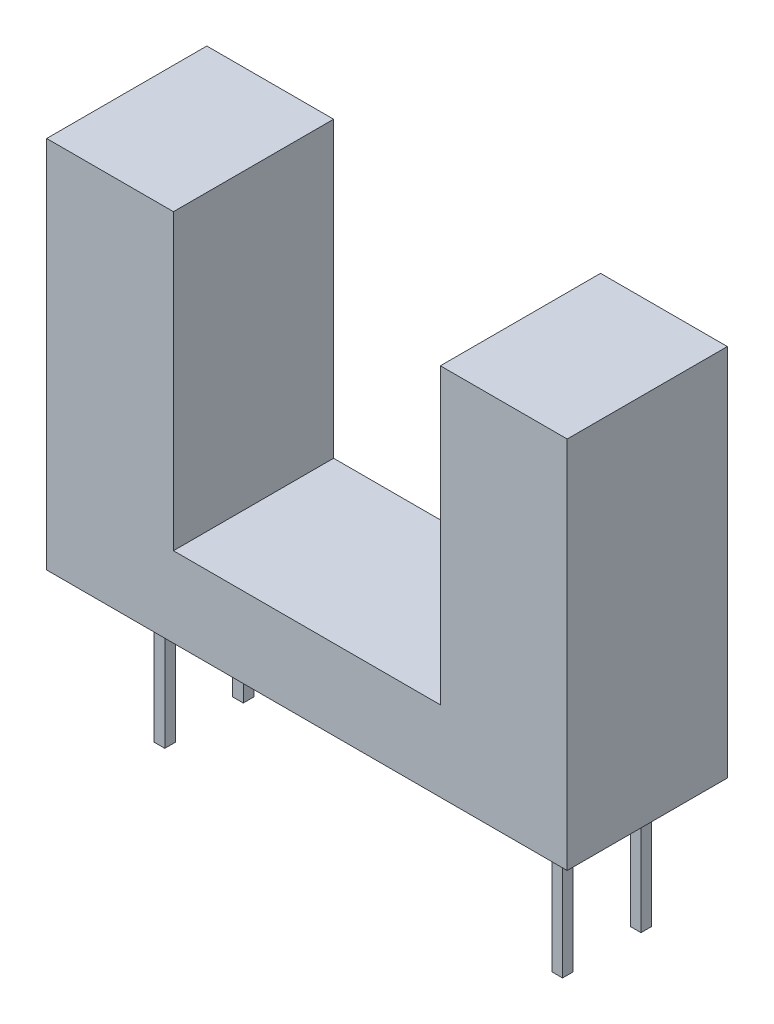
ISO-10303-21;
HEADER;
FILE_DESCRIPTION(('STEP AP214'),'2;1');
FILE_NAME('part.step','',(''),(''),'','','');
FILE_SCHEMA(('AUTOMOTIVE_DESIGN { 1 0 10303 214 1 1 1 1 }'));
ENDSEC;
DATA;
#1=APPLICATION_CONTEXT('core data for automotive mechanical design processes');
#2=APPLICATION_PROTOCOL_DEFINITION('international standard','automotive_design',2000,#1);
#3=PRODUCT_CONTEXT('',#1,'mechanical');
#4=PRODUCT('Part','Part','',(#3));
#5=PRODUCT_RELATED_PRODUCT_CATEGORY('part','',(#4));
#6=PRODUCT_DEFINITION_FORMATION('','',#4);
#7=PRODUCT_DEFINITION_CONTEXT('part definition',#1,'design');
#8=PRODUCT_DEFINITION('design','',#6,#7);
#9=PRODUCT_DEFINITION_SHAPE('','',#8);
#10=(LENGTH_UNIT() NAMED_UNIT(*) SI_UNIT(.MILLI.,.METRE.));
#11=(NAMED_UNIT(*) PLANE_ANGLE_UNIT() SI_UNIT($,.RADIAN.));
#12=(NAMED_UNIT(*) SI_UNIT($,.STERADIAN.) SOLID_ANGLE_UNIT());
#13=UNCERTAINTY_MEASURE_WITH_UNIT(LENGTH_MEASURE(1.E-05),#10,'distance_accuracy_value','');
#14=(GEOMETRIC_REPRESENTATION_CONTEXT(3) GLOBAL_UNCERTAINTY_ASSIGNED_CONTEXT((#13)) GLOBAL_UNIT_ASSIGNED_CONTEXT((#10,
#11,#12)) REPRESENTATION_CONTEXT('',''));
#15=CARTESIAN_POINT('',(0.,0.,0.));
#16=DIRECTION('',(0.,0.,1.));
#17=DIRECTION('',(1.,0.,0.));
#18=AXIS2_PLACEMENT_3D('',#15,#16,#17);
#19=CARTESIAN_POINT('',(-9.75,-7.,6.));
#20=DIRECTION('',(0.,1.,0.));
#21=DIRECTION('',(0.,0.,1.));
#22=AXIS2_PLACEMENT_3D('',#19,#20,#21);
#23=PLANE('',#22);
#24=DIRECTION('',(-1.,0.,0.));
#25=VECTOR('',#24,1.);
#26=CARTESIAN_POINT('',(7.65,-7.,1.13433300913482));
#27=LINE('',#26,#25);
#28=CARTESIAN_POINT('',(7.65,-7.,1.13433300913482));
#29=VERTEX_POINT('',#28);
#30=CARTESIAN_POINT('',(7.25,-7.,1.13433300913482));
#31=VERTEX_POINT('',#30);
#32=EDGE_CURVE('E223',#29,#31,#27,.T.);
#33=ORIENTED_EDGE('',*,*,#32,.F.);
#34=DIRECTION('',(0.,0.,1.));
#35=VECTOR('',#34,1.);
#36=CARTESIAN_POINT('',(7.65,-7.,1.13433300913482));
#37=LINE('',#36,#35);
#38=CARTESIAN_POINT('',(7.65,-7.,0.734333009134821));
#39=VERTEX_POINT('',#38);
#40=EDGE_CURVE('E255',#39,#29,#37,.T.);
#41=ORIENTED_EDGE('',*,*,#40,.F.);
#42=DIRECTION('',(1.,0.,0.));
#43=VECTOR('',#42,1.);
#44=CARTESIAN_POINT('',(7.65,-7.,0.734333009134821));
#45=LINE('',#44,#43);
#46=CARTESIAN_POINT('',(7.25,-7.,0.734333009134821));
#47=VERTEX_POINT('',#46);
#48=EDGE_CURVE('E260',#47,#39,#45,.T.);
#49=ORIENTED_EDGE('',*,*,#48,.F.);
#50=DIRECTION('',(0.,0.,-1.));
#51=VECTOR('',#50,1.);
#52=CARTESIAN_POINT('',(7.25,-7.,1.13433300913482));
#53=LINE('',#52,#51);
#54=EDGE_CURVE('E261',#31,#47,#53,.T.);
#55=ORIENTED_EDGE('',*,*,#54,.F.);
#56=EDGE_LOOP('',(#33,#41,#49,#55));
#57=FACE_BOUND('',#56,.T.);
#58=DIRECTION('',(0.,0.,-1.));
#59=VECTOR('',#58,1.);
#60=CARTESIAN_POINT('',(-7.65,-7.,4.07433300913482));
#61=LINE('',#60,#59);
#62=CARTESIAN_POINT('',(-7.65,-7.,4.07433300913482));
#63=VERTEX_POINT('',#62);
#64=CARTESIAN_POINT('',(-7.65,-7.,3.67433300913482));
#65=VERTEX_POINT('',#64);
#66=EDGE_CURVE('E233',#63,#65,#61,.T.);
#67=ORIENTED_EDGE('',*,*,#66,.F.);
#68=DIRECTION('',(-1.,0.,0.));
#69=VECTOR('',#68,1.);
#70=CARTESIAN_POINT('',(-7.65,-7.,4.07433300913482));
#71=LINE('',#70,#69);
#72=CARTESIAN_POINT('',(-7.25,-7.,4.07433300913482));
#73=VERTEX_POINT('',#72);
#74=EDGE_CURVE('E305',#73,#63,#71,.T.);
#75=ORIENTED_EDGE('',*,*,#74,.F.);
#76=DIRECTION('',(0.,0.,1.));
#77=VECTOR('',#76,1.);
#78=CARTESIAN_POINT('',(-7.25,-7.,4.07433300913482));
#79=LINE('',#78,#77);
#80=CARTESIAN_POINT('',(-7.25,-7.,3.67433300913482));
#81=VERTEX_POINT('',#80);
#82=EDGE_CURVE('E320',#81,#73,#79,.T.);
#83=ORIENTED_EDGE('',*,*,#82,.F.);
#84=DIRECTION('',(1.,0.,0.));
#85=VECTOR('',#84,1.);
#86=CARTESIAN_POINT('',(-7.65,-7.,3.67433300913482));
#87=LINE('',#86,#85);
#88=EDGE_CURVE('E314',#65,#81,#87,.T.);
#89=ORIENTED_EDGE('',*,*,#88,.F.);
#90=EDGE_LOOP('',(#67,#75,#83,#89));
#91=FACE_BOUND('',#90,.T.);
#92=DIRECTION('',(1.,0.,0.));
#93=VECTOR('',#92,1.);
#94=CARTESIAN_POINT('',(-9.75,-7.,0.));
#95=LINE('',#94,#93);
#96=CARTESIAN_POINT('',(-9.75,-7.,0.));
#97=VERTEX_POINT('',#96);
#98=CARTESIAN_POINT('',(9.75,-7.,0.));
#99=VERTEX_POINT('',#98);
#100=EDGE_CURVE('E373',#97,#99,#95,.T.);
#101=ORIENTED_EDGE('',*,*,#100,.T.);
#102=DIRECTION('',(0.,0.,-1.));
#103=VECTOR('',#102,1.);
#104=CARTESIAN_POINT('',(9.75,-7.,6.));
#105=LINE('',#104,#103);
#106=CARTESIAN_POINT('',(9.75,-7.,6.));
#107=VERTEX_POINT('',#106);
#108=EDGE_CURVE('E377',#107,#99,#105,.T.);
#109=ORIENTED_EDGE('',*,*,#108,.F.);
#110=DIRECTION('',(1.,0.,0.));
#111=VECTOR('',#110,1.);
#112=CARTESIAN_POINT('',(-9.75,-7.,6.));
#113=LINE('',#112,#111);
#114=CARTESIAN_POINT('',(-9.75,-7.,6.));
#115=VERTEX_POINT('',#114);
#116=EDGE_CURVE('E355',#115,#107,#113,.T.);
#117=ORIENTED_EDGE('',*,*,#116,.F.);
#118=DIRECTION('',(0.,0.,-1.));
#119=VECTOR('',#118,1.);
#120=CARTESIAN_POINT('',(-9.75,-7.,6.));
#121=LINE('',#120,#119);
#122=EDGE_CURVE('E48',#115,#97,#121,.T.);
#123=ORIENTED_EDGE('',*,*,#122,.T.);
#124=EDGE_LOOP('',(#101,#109,#117,#123));
#125=FACE_BOUND('',#124,.T.);
#126=DIRECTION('',(0.,0.,-1.));
#127=VECTOR('',#126,1.);
#128=CARTESIAN_POINT('',(-7.65,-7.,1.13433300913482));
#129=LINE('',#128,#127);
#130=CARTESIAN_POINT('',(-7.65,-7.,1.13433300913482));
#131=VERTEX_POINT('',#130);
#132=CARTESIAN_POINT('',(-7.65,-7.,0.734333009134819));
#133=VERTEX_POINT('',#132);
#134=EDGE_CURVE('E220',#131,#133,#129,.T.);
#135=ORIENTED_EDGE('',*,*,#134,.F.);
#136=DIRECTION('',(-1.,0.,0.));
#137=VECTOR('',#136,1.);
#138=CARTESIAN_POINT('',(-7.65,-7.,1.13433300913482));
#139=LINE('',#138,#137);
#140=CARTESIAN_POINT('',(-7.25,-7.,1.13433300913482));
#141=VERTEX_POINT('',#140);
#142=EDGE_CURVE('E201',#141,#131,#139,.T.);
#143=ORIENTED_EDGE('',*,*,#142,.F.);
#144=DIRECTION('',(0.,0.,1.));
#145=VECTOR('',#144,1.);
#146=CARTESIAN_POINT('',(-7.25,-7.,1.13433300913482));
#147=LINE('',#146,#145);
#148=CARTESIAN_POINT('',(-7.25,-7.,0.734333009134819));
#149=VERTEX_POINT('',#148);
#150=EDGE_CURVE('E196',#149,#141,#147,.T.);
#151=ORIENTED_EDGE('',*,*,#150,.F.);
#152=DIRECTION('',(1.,0.,0.));
#153=VECTOR('',#152,1.);
#154=CARTESIAN_POINT('',(-7.65,-7.,0.734333009134819));
#155=LINE('',#154,#153);
#156=EDGE_CURVE('E199',#133,#149,#155,.T.);
#157=ORIENTED_EDGE('',*,*,#156,.F.);
#158=EDGE_LOOP('',(#135,#143,#151,#157));
#159=FACE_BOUND('',#158,.T.);
#160=DIRECTION('',(-1.,0.,0.));
#161=VECTOR('',#160,1.);
#162=CARTESIAN_POINT('',(7.65,-7.,4.07433300913482));
#163=LINE('',#162,#161);
#164=CARTESIAN_POINT('',(7.65,-7.,4.07433300913482));
#165=VERTEX_POINT('',#164);
#166=CARTESIAN_POINT('',(7.25,-7.,4.07433300913482));
#167=VERTEX_POINT('',#166);
#168=EDGE_CURVE('E57',#165,#167,#163,.T.);
#169=ORIENTED_EDGE('',*,*,#168,.F.);
#170=DIRECTION('',(0.,0.,1.));
#171=VECTOR('',#170,1.);
#172=CARTESIAN_POINT('',(7.65,-7.,4.07433300913482));
#173=LINE('',#172,#171);
#174=CARTESIAN_POINT('',(7.65,-7.,3.67433300913482));
#175=VERTEX_POINT('',#174);
#176=EDGE_CURVE('E58',#175,#165,#173,.T.);
#177=ORIENTED_EDGE('',*,*,#176,.F.);
#178=DIRECTION('',(1.,0.,0.));
#179=VECTOR('',#178,1.);
#180=CARTESIAN_POINT('',(7.65,-7.,3.67433300913482));
#181=LINE('',#180,#179);
#182=CARTESIAN_POINT('',(7.25,-7.,3.67433300913482));
#183=VERTEX_POINT('',#182);
#184=EDGE_CURVE('E287',#183,#175,#181,.T.);
#185=ORIENTED_EDGE('',*,*,#184,.F.);
#186=DIRECTION('',(0.,0.,-1.));
#187=VECTOR('',#186,1.);
#188=CARTESIAN_POINT('',(7.25,-7.,4.07433300913482));
#189=LINE('',#188,#187);
#190=EDGE_CURVE('E290',#167,#183,#189,.T.);
#191=ORIENTED_EDGE('',*,*,#190,.F.);
#192=EDGE_LOOP('',(#169,#177,#185,#191));
#193=FACE_BOUND('',#192,.T.);
#194=ADVANCED_FACE('F39',(#57,#91,#125,#159,#193),#23,.F.);
#195=CARTESIAN_POINT('',(-9.75,7.,6.));
#196=DIRECTION('',(0.,1.,0.));
#197=DIRECTION('',(0.,0.,1.));
#198=AXIS2_PLACEMENT_3D('',#195,#196,#197);
#199=PLANE('',#198);
#200=DIRECTION('',(1.,0.,0.));
#201=VECTOR('',#200,1.);
#202=CARTESIAN_POINT('',(-9.75,7.,0.));
#203=LINE('',#202,#201);
#204=CARTESIAN_POINT('',(-9.75,7.,0.));
#205=VERTEX_POINT('',#204);
#206=CARTESIAN_POINT('',(-5.,7.,0.));
#207=VERTEX_POINT('',#206);
#208=EDGE_CURVE('E334',#205,#207,#203,.T.);
#209=ORIENTED_EDGE('',*,*,#208,.F.);
#210=DIRECTION('',(0.,0.,-1.));
#211=VECTOR('',#210,1.);
#212=CARTESIAN_POINT('',(-9.75,7.,6.));
#213=LINE('',#212,#211);
#214=CARTESIAN_POINT('',(-9.75,7.,6.));
#215=VERTEX_POINT('',#214);
#216=EDGE_CURVE('E11',#215,#205,#213,.T.);
#217=ORIENTED_EDGE('',*,*,#216,.F.);
#218=DIRECTION('',(1.,0.,0.));
#219=VECTOR('',#218,1.);
#220=CARTESIAN_POINT('',(-9.75,7.,6.));
#221=LINE('',#220,#219);
#222=CARTESIAN_POINT('',(-5.,7.,6.));
#223=VERTEX_POINT('',#222);
#224=EDGE_CURVE('E331',#215,#223,#221,.T.);
#225=ORIENTED_EDGE('',*,*,#224,.T.);
#226=DIRECTION('',(0.,0.,-1.));
#227=VECTOR('',#226,1.);
#228=CARTESIAN_POINT('',(-5.,7.,6.));
#229=LINE('',#228,#227);
#230=EDGE_CURVE('E43',#223,#207,#229,.T.);
#231=ORIENTED_EDGE('',*,*,#230,.T.);
#232=EDGE_LOOP('',(#209,#217,#225,#231));
#233=FACE_BOUND('',#232,.T.);
#234=ADVANCED_FACE('F41',(#233),#199,.T.);
#235=CARTESIAN_POINT('',(-9.75,7.,6.));
#236=DIRECTION('',(1.,0.,0.));
#237=DIRECTION('',(0.,1.,0.));
#238=AXIS2_PLACEMENT_3D('',#235,#236,#237);
#239=PLANE('',#238);
#240=DIRECTION('',(0.,-1.,0.));
#241=VECTOR('',#240,1.);
#242=CARTESIAN_POINT('',(-9.75,7.,0.));
#243=LINE('',#242,#241);
#244=EDGE_CURVE('E337',#205,#97,#243,.T.);
#245=ORIENTED_EDGE('',*,*,#244,.T.);
#246=ORIENTED_EDGE('',*,*,#122,.F.);
#247=DIRECTION('',(0.,-1.,0.));
#248=VECTOR('',#247,1.);
#249=CARTESIAN_POINT('',(-9.75,7.,6.));
#250=LINE('',#249,#248);
#251=EDGE_CURVE('E353',#215,#115,#250,.T.);
#252=ORIENTED_EDGE('',*,*,#251,.F.);
#253=ORIENTED_EDGE('',*,*,#216,.T.);
#254=EDGE_LOOP('',(#245,#246,#252,#253));
#255=FACE_BOUND('',#254,.T.);
#256=ADVANCED_FACE('F402',(#255),#239,.F.);
#257=CARTESIAN_POINT('',(9.75,7.,6.));
#258=DIRECTION('',(1.,0.,0.));
#259=DIRECTION('',(0.,1.,0.));
#260=AXIS2_PLACEMENT_3D('',#257,#258,#259);
#261=PLANE('',#260);
#262=DIRECTION('',(0.,-1.,0.));
#263=VECTOR('',#262,1.);
#264=CARTESIAN_POINT('',(9.75,7.,0.));
#265=LINE('',#264,#263);
#266=CARTESIAN_POINT('',(9.75,7.,0.));
#267=VERTEX_POINT('',#266);
#268=EDGE_CURVE('E367',#267,#99,#265,.T.);
#269=ORIENTED_EDGE('',*,*,#268,.F.);
#270=DIRECTION('',(0.,0.,-1.));
#271=VECTOR('',#270,1.);
#272=CARTESIAN_POINT('',(9.75,7.,6.));
#273=LINE('',#272,#271);
#274=CARTESIAN_POINT('',(9.75,7.,6.));
#275=VERTEX_POINT('',#274);
#276=EDGE_CURVE('E381',#275,#267,#273,.T.);
#277=ORIENTED_EDGE('',*,*,#276,.F.);
#278=DIRECTION('',(0.,-1.,0.));
#279=VECTOR('',#278,1.);
#280=CARTESIAN_POINT('',(9.75,7.,6.));
#281=LINE('',#280,#279);
#282=EDGE_CURVE('E349',#275,#107,#281,.T.);
#283=ORIENTED_EDGE('',*,*,#282,.T.);
#284=ORIENTED_EDGE('',*,*,#108,.T.);
#285=EDGE_LOOP('',(#269,#277,#283,#284));
#286=FACE_BOUND('',#285,.T.);
#287=ADVANCED_FACE('F425',(#286),#261,.T.);
#288=CARTESIAN_POINT('',(5.,7.,6.));
#289=DIRECTION('',(0.,1.,0.));
#290=DIRECTION('',(-1.,0.,0.));
#291=AXIS2_PLACEMENT_3D('',#288,#289,#290);
#292=PLANE('',#291);
#293=DIRECTION('',(1.,0.,0.));
#294=VECTOR('',#293,1.);
#295=CARTESIAN_POINT('',(5.,7.,0.));
#296=LINE('',#295,#294);
#297=CARTESIAN_POINT('',(5.,7.,0.));
#298=VERTEX_POINT('',#297);
#299=EDGE_CURVE('E370',#298,#267,#296,.T.);
#300=ORIENTED_EDGE('',*,*,#299,.F.);
#301=DIRECTION('',(0.,0.,-1.));
#302=VECTOR('',#301,1.);
#303=CARTESIAN_POINT('',(5.,7.,6.));
#304=LINE('',#303,#302);
#305=CARTESIAN_POINT('',(5.,7.,6.));
#306=VERTEX_POINT('',#305);
#307=EDGE_CURVE('E382',#306,#298,#304,.T.);
#308=ORIENTED_EDGE('',*,*,#307,.F.);
#309=DIRECTION('',(1.,0.,0.));
#310=VECTOR('',#309,1.);
#311=CARTESIAN_POINT('',(5.,7.,6.));
#312=LINE('',#311,#310);
#313=EDGE_CURVE('E347',#306,#275,#312,.T.);
#314=ORIENTED_EDGE('',*,*,#313,.T.);
#315=ORIENTED_EDGE('',*,*,#276,.T.);
#316=EDGE_LOOP('',(#300,#308,#314,#315));
#317=FACE_BOUND('',#316,.T.);
#318=ADVANCED_FACE('F420',(#317),#292,.T.);
#319=CARTESIAN_POINT('',(5.,7.,6.));
#320=DIRECTION('',(1.,0.,0.));
#321=DIRECTION('',(0.,1.,0.));
#322=AXIS2_PLACEMENT_3D('',#319,#320,#321);
#323=PLANE('',#322);
#324=DIRECTION('',(0.,-1.,0.));
#325=VECTOR('',#324,1.);
#326=CARTESIAN_POINT('',(5.,7.,0.));
#327=LINE('',#326,#325);
#328=CARTESIAN_POINT('',(5.,-4.,0.));
#329=VERTEX_POINT('',#328);
#330=EDGE_CURVE('E365',#298,#329,#327,.T.);
#331=ORIENTED_EDGE('',*,*,#330,.T.);
#332=DIRECTION('',(0.,0.,-1.));
#333=VECTOR('',#332,1.);
#334=CARTESIAN_POINT('',(5.,-4.,6.));
#335=LINE('',#334,#333);
#336=CARTESIAN_POINT('',(5.,-4.,6.));
#337=VERTEX_POINT('',#336);
#338=EDGE_CURVE('E384',#337,#329,#335,.T.);
#339=ORIENTED_EDGE('',*,*,#338,.F.);
#340=DIRECTION('',(0.,-1.,0.));
#341=VECTOR('',#340,1.);
#342=CARTESIAN_POINT('',(5.,7.,6.));
#343=LINE('',#342,#341);
#344=EDGE_CURVE('E343',#306,#337,#343,.T.);
#345=ORIENTED_EDGE('',*,*,#344,.F.);
#346=ORIENTED_EDGE('',*,*,#307,.T.);
#347=EDGE_LOOP('',(#331,#339,#345,#346));
#348=FACE_BOUND('',#347,.T.);
#349=ADVANCED_FACE('F427',(#348),#323,.F.);
#350=CARTESIAN_POINT('',(-5.,-4.,6.));
#351=DIRECTION('',(0.,1.,0.));
#352=DIRECTION('',(-1.,0.,0.));
#353=AXIS2_PLACEMENT_3D('',#350,#351,#352);
#354=PLANE('',#353);
#355=DIRECTION('',(1.,0.,0.));
#356=VECTOR('',#355,1.);
#357=CARTESIAN_POINT('',(-5.,-4.,0.));
#358=LINE('',#357,#356);
#359=CARTESIAN_POINT('',(-5.,-4.,0.));
#360=VERTEX_POINT('',#359);
#361=EDGE_CURVE('E363',#360,#329,#358,.T.);
#362=ORIENTED_EDGE('',*,*,#361,.F.);
#363=DIRECTION('',(0.,0.,-1.));
#364=VECTOR('',#363,1.);
#365=CARTESIAN_POINT('',(-5.,-4.,6.));
#366=LINE('',#365,#364);
#367=CARTESIAN_POINT('',(-5.,-4.,6.));
#368=VERTEX_POINT('',#367);
#369=EDGE_CURVE('E387',#368,#360,#366,.T.);
#370=ORIENTED_EDGE('',*,*,#369,.F.);
#371=DIRECTION('',(1.,0.,0.));
#372=VECTOR('',#371,1.);
#373=CARTESIAN_POINT('',(-5.,-4.,6.));
#374=LINE('',#373,#372);
#375=EDGE_CURVE('E341',#368,#337,#374,.T.);
#376=ORIENTED_EDGE('',*,*,#375,.T.);
#377=ORIENTED_EDGE('',*,*,#338,.T.);
#378=EDGE_LOOP('',(#362,#370,#376,#377));
#379=FACE_BOUND('',#378,.T.);
#380=ADVANCED_FACE('F413',(#379),#354,.T.);
#381=CARTESIAN_POINT('',(-5.,7.,6.));
#382=DIRECTION('',(1.,0.,0.));
#383=DIRECTION('',(0.,1.,0.));
#384=AXIS2_PLACEMENT_3D('',#381,#382,#383);
#385=PLANE('',#384);
#386=DIRECTION('',(0.,-1.,0.));
#387=VECTOR('',#386,1.);
#388=CARTESIAN_POINT('',(-5.,7.,0.));
#389=LINE('',#388,#387);
#390=EDGE_CURVE('E359',#207,#360,#389,.T.);
#391=ORIENTED_EDGE('',*,*,#390,.F.);
#392=ORIENTED_EDGE('',*,*,#230,.F.);
#393=DIRECTION('',(0.,-1.,0.));
#394=VECTOR('',#393,1.);
#395=CARTESIAN_POINT('',(-5.,7.,6.));
#396=LINE('',#395,#394);
#397=EDGE_CURVE('E340',#223,#368,#396,.T.);
#398=ORIENTED_EDGE('',*,*,#397,.T.);
#399=ORIENTED_EDGE('',*,*,#369,.T.);
#400=EDGE_LOOP('',(#391,#392,#398,#399));
#401=FACE_BOUND('',#400,.T.);
#402=ADVANCED_FACE('F393',(#401),#385,.T.);
#403=CARTESIAN_POINT('',(0.,0.,6.));
#404=DIRECTION('',(0.,0.,-1.));
#405=DIRECTION('',(-1.,0.,0.));
#406=AXIS2_PLACEMENT_3D('',#403,#404,#405);
#407=PLANE('',#406);
#408=ORIENTED_EDGE('',*,*,#224,.F.);
#409=ORIENTED_EDGE('',*,*,#251,.T.);
#410=ORIENTED_EDGE('',*,*,#116,.T.);
#411=ORIENTED_EDGE('',*,*,#282,.F.);
#412=ORIENTED_EDGE('',*,*,#313,.F.);
#413=ORIENTED_EDGE('',*,*,#344,.T.);
#414=ORIENTED_EDGE('',*,*,#375,.F.);
#415=ORIENTED_EDGE('',*,*,#397,.F.);
#416=EDGE_LOOP('',(#408,#409,#410,#411,#412,#413,#414,#415));
#417=FACE_BOUND('',#416,.T.);
#418=ADVANCED_FACE('F407',(#417),#407,.F.);
#419=CARTESIAN_POINT('',(0.,0.,0.));
#420=DIRECTION('',(0.,0.,-1.));
#421=DIRECTION('',(-1.,0.,0.));
#422=AXIS2_PLACEMENT_3D('',#419,#420,#421);
#423=PLANE('',#422);
#424=ORIENTED_EDGE('',*,*,#208,.T.);
#425=ORIENTED_EDGE('',*,*,#390,.T.);
#426=ORIENTED_EDGE('',*,*,#361,.T.);
#427=ORIENTED_EDGE('',*,*,#330,.F.);
#428=ORIENTED_EDGE('',*,*,#299,.T.);
#429=ORIENTED_EDGE('',*,*,#268,.T.);
#430=ORIENTED_EDGE('',*,*,#100,.F.);
#431=ORIENTED_EDGE('',*,*,#244,.F.);
#432=EDGE_LOOP('',(#424,#425,#426,#427,#428,#429,#430,#431));
#433=FACE_BOUND('',#432,.T.);
#434=ADVANCED_FACE('F397',(#433),#423,.T.);
#435=CARTESIAN_POINT('',(-7.65,-12.5,4.07433300913482));
#436=DIRECTION('',(1.,0.,0.));
#437=DIRECTION('',(0.,0.,-1.));
#438=AXIS2_PLACEMENT_3D('',#435,#436,#437);
#439=PLANE('',#438);
#440=ORIENTED_EDGE('',*,*,#66,.T.);
#441=DIRECTION('',(0.,1.,0.));
#442=VECTOR('',#441,1.);
#443=CARTESIAN_POINT('',(-7.65,-12.5,3.67433300913482));
#444=LINE('',#443,#442);
#445=CARTESIAN_POINT('',(-7.65,-12.5,3.67433300913482));
#446=VERTEX_POINT('',#445);
#447=EDGE_CURVE('E329',#446,#65,#444,.T.);
#448=ORIENTED_EDGE('',*,*,#447,.F.);
#449=DIRECTION('',(0.,0.,-1.));
#450=VECTOR('',#449,1.);
#451=CARTESIAN_POINT('',(-7.65,-12.5,4.07433300913482));
#452=LINE('',#451,#450);
#453=CARTESIAN_POINT('',(-7.65,-12.5,4.07433300913482));
#454=VERTEX_POINT('',#453);
#455=EDGE_CURVE('E301',#454,#446,#452,.T.);
#456=ORIENTED_EDGE('',*,*,#455,.F.);
#457=DIRECTION('',(0.,1.,0.));
#458=VECTOR('',#457,1.);
#459=CARTESIAN_POINT('',(-7.65,-12.5,4.07433300913482));
#460=LINE('',#459,#458);
#461=EDGE_CURVE('E313',#454,#63,#460,.T.);
#462=ORIENTED_EDGE('',*,*,#461,.T.);
#463=EDGE_LOOP('',(#440,#448,#456,#462));
#464=FACE_BOUND('',#463,.T.);
#465=ADVANCED_FACE('F444',(#464),#439,.F.);
#466=CARTESIAN_POINT('',(-7.65,-12.5,3.67433300913482));
#467=DIRECTION('',(0.,0.,1.));
#468=DIRECTION('',(1.,0.,0.));
#469=AXIS2_PLACEMENT_3D('',#466,#467,#468);
#470=PLANE('',#469);
#471=ORIENTED_EDGE('',*,*,#88,.T.);
#472=DIRECTION('',(0.,1.,0.));
#473=VECTOR('',#472,1.);
#474=CARTESIAN_POINT('',(-7.25,-12.5,3.67433300913482));
#475=LINE('',#474,#473);
#476=CARTESIAN_POINT('',(-7.25,-12.5,3.67433300913482));
#477=VERTEX_POINT('',#476);
#478=EDGE_CURVE('E330',#477,#81,#475,.T.);
#479=ORIENTED_EDGE('',*,*,#478,.F.);
#480=DIRECTION('',(1.,0.,0.));
#481=VECTOR('',#480,1.);
#482=CARTESIAN_POINT('',(-7.65,-12.5,3.67433300913482));
#483=LINE('',#482,#481);
#484=EDGE_CURVE('E303',#446,#477,#483,.T.);
#485=ORIENTED_EDGE('',*,*,#484,.F.);
#486=ORIENTED_EDGE('',*,*,#447,.T.);
#487=EDGE_LOOP('',(#471,#479,#485,#486));
#488=FACE_BOUND('',#487,.T.);
#489=ADVANCED_FACE('F450',(#488),#470,.F.);
#490=CARTESIAN_POINT('',(-7.25,-12.5,4.07433300913482));
#491=DIRECTION('',(-1.,0.,0.));
#492=DIRECTION('',(0.,0.,1.));
#493=AXIS2_PLACEMENT_3D('',#490,#491,#492);
#494=PLANE('',#493);
#495=ORIENTED_EDGE('',*,*,#82,.T.);
#496=DIRECTION('',(0.,1.,0.));
#497=VECTOR('',#496,1.);
#498=CARTESIAN_POINT('',(-7.25,-12.5,4.07433300913482));
#499=LINE('',#498,#497);
#500=CARTESIAN_POINT('',(-7.25,-12.5,4.07433300913482));
#501=VERTEX_POINT('',#500);
#502=EDGE_CURVE('E322',#501,#73,#499,.T.);
#503=ORIENTED_EDGE('',*,*,#502,.F.);
#504=DIRECTION('',(0.,0.,1.));
#505=VECTOR('',#504,1.);
#506=CARTESIAN_POINT('',(-7.25,-12.5,4.07433300913482));
#507=LINE('',#506,#505);
#508=EDGE_CURVE('E307',#477,#501,#507,.T.);
#509=ORIENTED_EDGE('',*,*,#508,.F.);
#510=ORIENTED_EDGE('',*,*,#478,.T.);
#511=EDGE_LOOP('',(#495,#503,#509,#510));
#512=FACE_BOUND('',#511,.T.);
#513=ADVANCED_FACE('F451',(#512),#494,.F.);
#514=CARTESIAN_POINT('',(-7.65,-12.5,4.07433300913482));
#515=DIRECTION('',(0.,0.,-1.));
#516=DIRECTION('',(-1.,0.,0.));
#517=AXIS2_PLACEMENT_3D('',#514,#515,#516);
#518=PLANE('',#517);
#519=ORIENTED_EDGE('',*,*,#74,.T.);
#520=ORIENTED_EDGE('',*,*,#461,.F.);
#521=DIRECTION('',(-1.,0.,0.));
#522=VECTOR('',#521,1.);
#523=CARTESIAN_POINT('',(-7.65,-12.5,4.07433300913482));
#524=LINE('',#523,#522);
#525=EDGE_CURVE('E310',#501,#454,#524,.T.);
#526=ORIENTED_EDGE('',*,*,#525,.F.);
#527=ORIENTED_EDGE('',*,*,#502,.T.);
#528=EDGE_LOOP('',(#519,#520,#526,#527));
#529=FACE_BOUND('',#528,.T.);
#530=ADVANCED_FACE('F455',(#529),#518,.F.);
#531=CARTESIAN_POINT('',(0.,-12.5,0.));
#532=DIRECTION('',(0.,-1.,0.));
#533=DIRECTION('',(0.,0.,-1.));
#534=AXIS2_PLACEMENT_3D('',#531,#532,#533);
#535=PLANE('',#534);
#536=ORIENTED_EDGE('',*,*,#455,.T.);
#537=ORIENTED_EDGE('',*,*,#484,.T.);
#538=ORIENTED_EDGE('',*,*,#508,.T.);
#539=ORIENTED_EDGE('',*,*,#525,.T.);
#540=EDGE_LOOP('',(#536,#537,#538,#539));
#541=FACE_BOUND('',#540,.T.);
#542=ADVANCED_FACE('F459',(#541),#535,.T.);
#543=CARTESIAN_POINT('',(-7.65,-12.5,1.13433300913482));
#544=DIRECTION('',(1.,0.,0.));
#545=DIRECTION('',(0.,0.,-1.));
#546=AXIS2_PLACEMENT_3D('',#543,#544,#545);
#547=PLANE('',#546);
#548=ORIENTED_EDGE('',*,*,#134,.T.);
#549=DIRECTION('',(0.,1.,0.));
#550=VECTOR('',#549,1.);
#551=CARTESIAN_POINT('',(-7.65,-12.5,0.734333009134819));
#552=LINE('',#551,#550);
#553=CARTESIAN_POINT('',(-7.65,-12.5,0.734333009134819));
#554=VERTEX_POINT('',#553);
#555=EDGE_CURVE('E214',#554,#133,#552,.T.);
#556=ORIENTED_EDGE('',*,*,#555,.F.);
#557=DIRECTION('',(0.,0.,-1.));
#558=VECTOR('',#557,1.);
#559=CARTESIAN_POINT('',(-7.65,-12.5,1.13433300913482));
#560=LINE('',#559,#558);
#561=CARTESIAN_POINT('',(-7.65,-12.5,1.13433300913482));
#562=VERTEX_POINT('',#561);
#563=EDGE_CURVE('E231',#562,#554,#560,.T.);
#564=ORIENTED_EDGE('',*,*,#563,.F.);
#565=DIRECTION('',(0.,1.,0.));
#566=VECTOR('',#565,1.);
#567=CARTESIAN_POINT('',(-7.65,-12.5,1.13433300913482));
#568=LINE('',#567,#566);
#569=EDGE_CURVE('E224',#562,#131,#568,.T.);
#570=ORIENTED_EDGE('',*,*,#569,.T.);
#571=EDGE_LOOP('',(#548,#556,#564,#570));
#572=FACE_BOUND('',#571,.T.);
#573=ADVANCED_FACE('F462',(#572),#547,.F.);
#574=CARTESIAN_POINT('',(-7.65,-12.5,0.734333009134819));
#575=DIRECTION('',(0.,0.,1.));
#576=DIRECTION('',(1.,0.,0.));
#577=AXIS2_PLACEMENT_3D('',#574,#575,#576);
#578=PLANE('',#577);
#579=ORIENTED_EDGE('',*,*,#156,.T.);
#580=DIRECTION('',(0.,1.,0.));
#581=VECTOR('',#580,1.);
#582=CARTESIAN_POINT('',(-7.25,-12.5,0.734333009134819));
#583=LINE('',#582,#581);
#584=CARTESIAN_POINT('',(-7.25,-12.5,0.734333009134819));
#585=VERTEX_POINT('',#584);
#586=EDGE_CURVE('E215',#585,#149,#583,.T.);
#587=ORIENTED_EDGE('',*,*,#586,.F.);
#588=DIRECTION('',(1.,0.,0.));
#589=VECTOR('',#588,1.);
#590=CARTESIAN_POINT('',(-7.65,-12.5,0.734333009134819));
#591=LINE('',#590,#589);
#592=EDGE_CURVE('E240',#554,#585,#591,.T.);
#593=ORIENTED_EDGE('',*,*,#592,.F.);
#594=ORIENTED_EDGE('',*,*,#555,.T.);
#595=EDGE_LOOP('',(#579,#587,#593,#594));
#596=FACE_BOUND('',#595,.T.);
#597=ADVANCED_FACE('F211',(#596),#578,.F.);
#598=CARTESIAN_POINT('',(-7.25,-12.5,1.13433300913482));
#599=DIRECTION('',(-1.,0.,0.));
#600=DIRECTION('',(0.,0.,1.));
#601=AXIS2_PLACEMENT_3D('',#598,#599,#600);
#602=PLANE('',#601);
#603=ORIENTED_EDGE('',*,*,#150,.T.);
#604=DIRECTION('',(0.,1.,0.));
#605=VECTOR('',#604,1.);
#606=CARTESIAN_POINT('',(-7.25,-12.5,1.13433300913482));
#607=LINE('',#606,#605);
#608=CARTESIAN_POINT('',(-7.25,-12.5,1.13433300913482));
#609=VERTEX_POINT('',#608);
#610=EDGE_CURVE('E222',#609,#141,#607,.T.);
#611=ORIENTED_EDGE('',*,*,#610,.F.);
#612=DIRECTION('',(0.,0.,1.));
#613=VECTOR('',#612,1.);
#614=CARTESIAN_POINT('',(-7.25,-12.5,1.13433300913482));
#615=LINE('',#614,#613);
#616=EDGE_CURVE('E219',#585,#609,#615,.T.);
#617=ORIENTED_EDGE('',*,*,#616,.F.);
#618=ORIENTED_EDGE('',*,*,#586,.T.);
#619=EDGE_LOOP('',(#603,#611,#617,#618));
#620=FACE_BOUND('',#619,.T.);
#621=ADVANCED_FACE('F218',(#620),#602,.F.);
#622=CARTESIAN_POINT('',(-7.65,-12.5,1.13433300913482));
#623=DIRECTION('',(0.,0.,-1.));
#624=DIRECTION('',(-1.,0.,0.));
#625=AXIS2_PLACEMENT_3D('',#622,#623,#624);
#626=PLANE('',#625);
#627=ORIENTED_EDGE('',*,*,#142,.T.);
#628=ORIENTED_EDGE('',*,*,#569,.F.);
#629=DIRECTION('',(-1.,0.,0.));
#630=VECTOR('',#629,1.);
#631=CARTESIAN_POINT('',(-7.65,-12.5,1.13433300913482));
#632=LINE('',#631,#630);
#633=EDGE_CURVE('E229',#609,#562,#632,.T.);
#634=ORIENTED_EDGE('',*,*,#633,.F.);
#635=ORIENTED_EDGE('',*,*,#610,.T.);
#636=EDGE_LOOP('',(#627,#628,#634,#635));
#637=FACE_BOUND('',#636,.T.);
#638=ADVANCED_FACE('F509',(#637),#626,.F.);
#639=CARTESIAN_POINT('',(0.,-12.5,0.));
#640=DIRECTION('',(0.,-1.,0.));
#641=DIRECTION('',(0.,0.,-1.));
#642=AXIS2_PLACEMENT_3D('',#639,#640,#641);
#643=PLANE('',#642);
#644=ORIENTED_EDGE('',*,*,#563,.T.);
#645=ORIENTED_EDGE('',*,*,#592,.T.);
#646=ORIENTED_EDGE('',*,*,#616,.T.);
#647=ORIENTED_EDGE('',*,*,#633,.T.);
#648=EDGE_LOOP('',(#644,#645,#646,#647));
#649=FACE_BOUND('',#648,.T.);
#650=ADVANCED_FACE('F503',(#649),#643,.T.);
#651=CARTESIAN_POINT('',(7.65,-12.5,1.13433300913482));
#652=DIRECTION('',(0.,0.,-1.));
#653=DIRECTION('',(-1.,0.,0.));
#654=AXIS2_PLACEMENT_3D('',#651,#652,#653);
#655=PLANE('',#654);
#656=ORIENTED_EDGE('',*,*,#32,.T.);
#657=DIRECTION('',(0.,1.,0.));
#658=VECTOR('',#657,1.);
#659=CARTESIAN_POINT('',(7.25,-12.5,1.13433300913482));
#660=LINE('',#659,#658);
#661=CARTESIAN_POINT('',(7.25,-12.5,1.13433300913482));
#662=VERTEX_POINT('',#661);
#663=EDGE_CURVE('E241',#662,#31,#660,.T.);
#664=ORIENTED_EDGE('',*,*,#663,.F.);
#665=DIRECTION('',(-1.,0.,0.));
#666=VECTOR('',#665,1.);
#667=CARTESIAN_POINT('',(7.65,-12.5,1.13433300913482));
#668=LINE('',#667,#666);
#669=CARTESIAN_POINT('',(7.65,-12.5,1.13433300913482));
#670=VERTEX_POINT('',#669);
#671=EDGE_CURVE('E256',#670,#662,#668,.T.);
#672=ORIENTED_EDGE('',*,*,#671,.F.);
#673=DIRECTION('',(0.,1.,0.));
#674=VECTOR('',#673,1.);
#675=CARTESIAN_POINT('',(7.65,-12.5,1.13433300913482));
#676=LINE('',#675,#674);
#677=EDGE_CURVE('E250',#670,#29,#676,.T.);
#678=ORIENTED_EDGE('',*,*,#677,.T.);
#679=EDGE_LOOP('',(#656,#664,#672,#678));
#680=FACE_BOUND('',#679,.T.);
#681=ADVANCED_FACE('F498',(#680),#655,.F.);
#682=CARTESIAN_POINT('',(7.25,-12.5,1.13433300913482));
#683=DIRECTION('',(1.,0.,0.));
#684=DIRECTION('',(0.,0.,-1.));
#685=AXIS2_PLACEMENT_3D('',#682,#683,#684);
#686=PLANE('',#685);
#687=ORIENTED_EDGE('',*,*,#54,.T.);
#688=DIRECTION('',(0.,1.,0.));
#689=VECTOR('',#688,1.);
#690=CARTESIAN_POINT('',(7.25,-12.5,0.734333009134821));
#691=LINE('',#690,#689);
#692=CARTESIAN_POINT('',(7.25,-12.5,0.734333009134821));
#693=VERTEX_POINT('',#692);
#694=EDGE_CURVE('E243',#693,#47,#691,.T.);
#695=ORIENTED_EDGE('',*,*,#694,.F.);
#696=DIRECTION('',(0.,0.,-1.));
#697=VECTOR('',#696,1.);
#698=CARTESIAN_POINT('',(7.25,-12.5,1.13433300913482));
#699=LINE('',#698,#697);
#700=EDGE_CURVE('E267',#662,#693,#699,.T.);
#701=ORIENTED_EDGE('',*,*,#700,.F.);
#702=ORIENTED_EDGE('',*,*,#663,.T.);
#703=EDGE_LOOP('',(#687,#695,#701,#702));
#704=FACE_BOUND('',#703,.T.);
#705=ADVANCED_FACE('F497',(#704),#686,.F.);
#706=CARTESIAN_POINT('',(7.65,-12.5,0.734333009134821));
#707=DIRECTION('',(0.,0.,1.));
#708=DIRECTION('',(1.,0.,0.));
#709=AXIS2_PLACEMENT_3D('',#706,#707,#708);
#710=PLANE('',#709);
#711=ORIENTED_EDGE('',*,*,#48,.T.);
#712=DIRECTION('',(0.,1.,0.));
#713=VECTOR('',#712,1.);
#714=CARTESIAN_POINT('',(7.65,-12.5,0.734333009134821));
#715=LINE('',#714,#713);
#716=CARTESIAN_POINT('',(7.65,-12.5,0.734333009134821));
#717=VERTEX_POINT('',#716);
#718=EDGE_CURVE('E247',#717,#39,#715,.T.);
#719=ORIENTED_EDGE('',*,*,#718,.F.);
#720=DIRECTION('',(1.,0.,0.));
#721=VECTOR('',#720,1.);
#722=CARTESIAN_POINT('',(7.65,-12.5,0.734333009134821));
#723=LINE('',#722,#721);
#724=EDGE_CURVE('E270',#693,#717,#723,.T.);
#725=ORIENTED_EDGE('',*,*,#724,.F.);
#726=ORIENTED_EDGE('',*,*,#694,.T.);
#727=EDGE_LOOP('',(#711,#719,#725,#726));
#728=FACE_BOUND('',#727,.T.);
#729=ADVANCED_FACE('F495',(#728),#710,.F.);
#730=CARTESIAN_POINT('',(7.65,-12.5,1.13433300913482));
#731=DIRECTION('',(-1.,0.,0.));
#732=DIRECTION('',(0.,0.,1.));
#733=AXIS2_PLACEMENT_3D('',#730,#731,#732);
#734=PLANE('',#733);
#735=ORIENTED_EDGE('',*,*,#40,.T.);
#736=ORIENTED_EDGE('',*,*,#677,.F.);
#737=DIRECTION('',(0.,0.,1.));
#738=VECTOR('',#737,1.);
#739=CARTESIAN_POINT('',(7.65,-12.5,1.13433300913482));
#740=LINE('',#739,#738);
#741=EDGE_CURVE('E251',#717,#670,#740,.T.);
#742=ORIENTED_EDGE('',*,*,#741,.F.);
#743=ORIENTED_EDGE('',*,*,#718,.T.);
#744=EDGE_LOOP('',(#735,#736,#742,#743));
#745=FACE_BOUND('',#744,.T.);
#746=ADVANCED_FACE('F488',(#745),#734,.F.);
#747=CARTESIAN_POINT('',(0.,-12.5,0.));
#748=DIRECTION('',(0.,-1.,0.));
#749=DIRECTION('',(0.,0.,-1.));
#750=AXIS2_PLACEMENT_3D('',#747,#748,#749);
#751=PLANE('',#750);
#752=ORIENTED_EDGE('',*,*,#671,.T.);
#753=ORIENTED_EDGE('',*,*,#700,.T.);
#754=ORIENTED_EDGE('',*,*,#724,.T.);
#755=ORIENTED_EDGE('',*,*,#741,.T.);
#756=EDGE_LOOP('',(#752,#753,#754,#755));
#757=FACE_BOUND('',#756,.T.);
#758=ADVANCED_FACE('F482',(#757),#751,.T.);
#759=CARTESIAN_POINT('',(7.65,-12.5,4.07433300913482));
#760=DIRECTION('',(0.,0.,-1.));
#761=DIRECTION('',(-1.,0.,0.));
#762=AXIS2_PLACEMENT_3D('',#759,#760,#761);
#763=PLANE('',#762);
#764=ORIENTED_EDGE('',*,*,#168,.T.);
#765=DIRECTION('',(0.,1.,0.));
#766=VECTOR('',#765,1.);
#767=CARTESIAN_POINT('',(7.25,-12.5,4.07433300913482));
#768=LINE('',#767,#766);
#769=CARTESIAN_POINT('',(7.25,-12.5,4.07433300913482));
#770=VERTEX_POINT('',#769);
#771=EDGE_CURVE('E272',#770,#167,#768,.T.);
#772=ORIENTED_EDGE('',*,*,#771,.F.);
#773=DIRECTION('',(-1.,0.,0.));
#774=VECTOR('',#773,1.);
#775=CARTESIAN_POINT('',(7.65,-12.5,4.07433300913482));
#776=LINE('',#775,#774);
#777=CARTESIAN_POINT('',(7.65,-12.5,4.07433300913482));
#778=VERTEX_POINT('',#777);
#779=EDGE_CURVE('E289',#778,#770,#776,.T.);
#780=ORIENTED_EDGE('',*,*,#779,.F.);
#781=DIRECTION('',(0.,1.,0.));
#782=VECTOR('',#781,1.);
#783=CARTESIAN_POINT('',(7.65,-12.5,4.07433300913482));
#784=LINE('',#783,#782);
#785=EDGE_CURVE('E285',#778,#165,#784,.T.);
#786=ORIENTED_EDGE('',*,*,#785,.T.);
#787=EDGE_LOOP('',(#764,#772,#780,#786));
#788=FACE_BOUND('',#787,.T.);
#789=ADVANCED_FACE('F477',(#788),#763,.F.);
#790=CARTESIAN_POINT('',(7.25,-12.5,4.07433300913482));
#791=DIRECTION('',(1.,0.,0.));
#792=DIRECTION('',(0.,0.,-1.));
#793=AXIS2_PLACEMENT_3D('',#790,#791,#792);
#794=PLANE('',#793);
#795=ORIENTED_EDGE('',*,*,#190,.T.);
#796=DIRECTION('',(0.,1.,0.));
#797=VECTOR('',#796,1.);
#798=CARTESIAN_POINT('',(7.25,-12.5,3.67433300913482));
#799=LINE('',#798,#797);
#800=CARTESIAN_POINT('',(7.25,-12.5,3.67433300913482));
#801=VERTEX_POINT('',#800);
#802=EDGE_CURVE('E277',#801,#183,#799,.T.);
#803=ORIENTED_EDGE('',*,*,#802,.F.);
#804=DIRECTION('',(0.,0.,-1.));
#805=VECTOR('',#804,1.);
#806=CARTESIAN_POINT('',(7.25,-12.5,4.07433300913482));
#807=LINE('',#806,#805);
#808=EDGE_CURVE('E300',#770,#801,#807,.T.);
#809=ORIENTED_EDGE('',*,*,#808,.F.);
#810=ORIENTED_EDGE('',*,*,#771,.T.);
#811=EDGE_LOOP('',(#795,#803,#809,#810));
#812=FACE_BOUND('',#811,.T.);
#813=ADVANCED_FACE('F478',(#812),#794,.F.);
#814=CARTESIAN_POINT('',(7.65,-12.5,3.67433300913482));
#815=DIRECTION('',(0.,0.,1.));
#816=DIRECTION('',(1.,0.,0.));
#817=AXIS2_PLACEMENT_3D('',#814,#815,#816);
#818=PLANE('',#817);
#819=ORIENTED_EDGE('',*,*,#184,.T.);
#820=DIRECTION('',(0.,1.,0.));
#821=VECTOR('',#820,1.);
#822=CARTESIAN_POINT('',(7.65,-12.5,3.67433300913482));
#823=LINE('',#822,#821);
#824=CARTESIAN_POINT('',(7.65,-12.5,3.67433300913482));
#825=VERTEX_POINT('',#824);
#826=EDGE_CURVE('E276',#825,#175,#823,.T.);
#827=ORIENTED_EDGE('',*,*,#826,.F.);
#828=DIRECTION('',(1.,0.,0.));
#829=VECTOR('',#828,1.);
#830=CARTESIAN_POINT('',(7.65,-12.5,3.67433300913482));
#831=LINE('',#830,#829);
#832=EDGE_CURVE('E293',#801,#825,#831,.T.);
#833=ORIENTED_EDGE('',*,*,#832,.F.);
#834=ORIENTED_EDGE('',*,*,#802,.T.);
#835=EDGE_LOOP('',(#819,#827,#833,#834));
#836=FACE_BOUND('',#835,.T.);
#837=ADVANCED_FACE('F472',(#836),#818,.F.);
#838=CARTESIAN_POINT('',(7.65,-12.5,4.07433300913482));
#839=DIRECTION('',(-1.,0.,0.));
#840=DIRECTION('',(0.,0.,1.));
#841=AXIS2_PLACEMENT_3D('',#838,#839,#840);
#842=PLANE('',#841);
#843=ORIENTED_EDGE('',*,*,#176,.T.);
#844=ORIENTED_EDGE('',*,*,#785,.F.);
#845=DIRECTION('',(0.,0.,1.));
#846=VECTOR('',#845,1.);
#847=CARTESIAN_POINT('',(7.65,-12.5,4.07433300913482));
#848=LINE('',#847,#846);
#849=EDGE_CURVE('E284',#825,#778,#848,.T.);
#850=ORIENTED_EDGE('',*,*,#849,.F.);
#851=ORIENTED_EDGE('',*,*,#826,.T.);
#852=EDGE_LOOP('',(#843,#844,#850,#851));
#853=FACE_BOUND('',#852,.T.);
#854=ADVANCED_FACE('F469',(#853),#842,.F.);
#855=CARTESIAN_POINT('',(0.,-12.5,0.));
#856=DIRECTION('',(0.,-1.,0.));
#857=DIRECTION('',(0.,0.,-1.));
#858=AXIS2_PLACEMENT_3D('',#855,#856,#857);
#859=PLANE('',#858);
#860=ORIENTED_EDGE('',*,*,#779,.T.);
#861=ORIENTED_EDGE('',*,*,#808,.T.);
#862=ORIENTED_EDGE('',*,*,#832,.T.);
#863=ORIENTED_EDGE('',*,*,#849,.T.);
#864=EDGE_LOOP('',(#860,#861,#862,#863));
#865=FACE_BOUND('',#864,.T.);
#866=ADVANCED_FACE('F464',(#865),#859,.T.);
#867=CLOSED_SHELL('',(#194,#234,#256,#287,#318,#349,#380,#402,#418,#434,#465,#489,#513,#530,
#542,#573,#597,#621,#638,#650,#681,#705,#729,#746,#758,#789,#813,#837,#854,#866));
#868=MANIFOLD_SOLID_BREP('B2',#867);
#869=ADVANCED_BREP_SHAPE_REPRESENTATION('',(#18,#868),#14);
#870=SHAPE_DEFINITION_REPRESENTATION(#9,#869);
ENDSEC;
END-ISO-10303-21;
